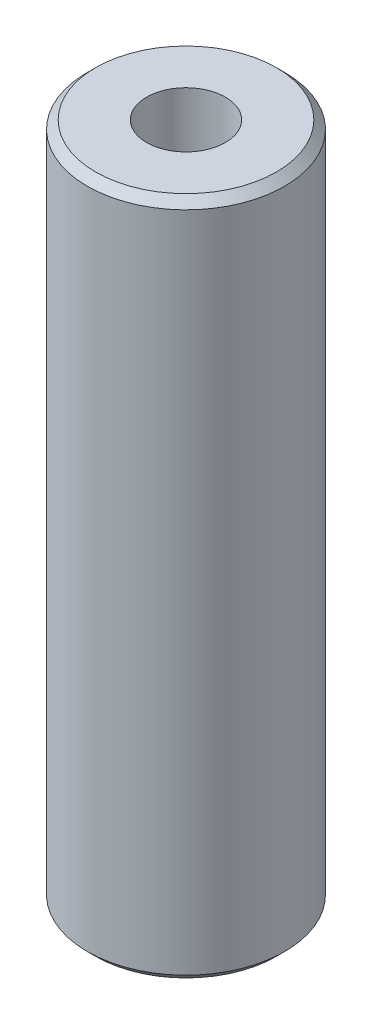
ISO-10303-21;
HEADER;
FILE_DESCRIPTION(('STEP AP214'),'2;1');
FILE_NAME('part.step','',(''),(''),'','','');
FILE_SCHEMA(('AUTOMOTIVE_DESIGN { 1 0 10303 214 1 1 1 1 }'));
ENDSEC;
DATA;
#1=APPLICATION_CONTEXT('core data for automotive mechanical design processes');
#2=APPLICATION_PROTOCOL_DEFINITION('international standard','automotive_design',2000,#1);
#3=PRODUCT_CONTEXT('',#1,'mechanical');
#4=PRODUCT('Part','Part','',(#3));
#5=PRODUCT_RELATED_PRODUCT_CATEGORY('part','',(#4));
#6=PRODUCT_DEFINITION_FORMATION('','',#4);
#7=PRODUCT_DEFINITION_CONTEXT('part definition',#1,'design');
#8=PRODUCT_DEFINITION('design','',#6,#7);
#9=PRODUCT_DEFINITION_SHAPE('','',#8);
#10=(LENGTH_UNIT() NAMED_UNIT(*) SI_UNIT(.MILLI.,.METRE.));
#11=(NAMED_UNIT(*) PLANE_ANGLE_UNIT() SI_UNIT($,.RADIAN.));
#12=(NAMED_UNIT(*) SI_UNIT($,.STERADIAN.) SOLID_ANGLE_UNIT());
#13=UNCERTAINTY_MEASURE_WITH_UNIT(LENGTH_MEASURE(1.E-05),#10,'distance_accuracy_value','');
#14=(GEOMETRIC_REPRESENTATION_CONTEXT(3) GLOBAL_UNCERTAINTY_ASSIGNED_CONTEXT((#13)) GLOBAL_UNIT_ASSIGNED_CONTEXT((#10,
#11,#12)) REPRESENTATION_CONTEXT('',''));
#15=CARTESIAN_POINT('',(0.,0.,0.));
#16=DIRECTION('',(0.,0.,1.));
#17=DIRECTION('',(1.,0.,0.));
#18=AXIS2_PLACEMENT_3D('',#15,#16,#17);
#19=CARTESIAN_POINT('',(0.,395.940282164828,0.));
#20=DIRECTION('',(0.,-1.,0.));
#21=DIRECTION('',(0.,0.,-1.));
#22=AXIS2_PLACEMENT_3D('',#19,#20,#21);
#23=CYLINDRICAL_SURFACE('',#22,57.5);
#24=CARTESIAN_POINT('',(0.,391.143993663756,0.));
#25=DIRECTION('',(0.,1.,0.));
#26=DIRECTION('',(0.,0.,1.));
#27=AXIS2_PLACEMENT_3D('',#24,#25,#26);
#28=CIRCLE('',#27,57.5);
#29=CARTESIAN_POINT('',(0.,391.143993663756,57.5));
#30=VERTEX_POINT('',#29);
#31=EDGE_CURVE('E50',#30,#30,#28,.F.);
#32=ORIENTED_EDGE('',*,*,#31,.T.);
#33=EDGE_LOOP('',(#32));
#34=FACE_BOUND('',#33,.T.);
#35=CARTESIAN_POINT('',(0.,4.79628850107244,0.));
#36=DIRECTION('',(0.,1.,0.));
#37=DIRECTION('',(0.,0.,1.));
#38=AXIS2_PLACEMENT_3D('',#35,#36,#37);
#39=CIRCLE('',#38,57.5);
#40=CARTESIAN_POINT('',(0.,4.79628850107244,57.5));
#41=VERTEX_POINT('',#40);
#42=EDGE_CURVE('E51',#41,#41,#39,.T.);
#43=ORIENTED_EDGE('',*,*,#42,.T.);
#44=EDGE_LOOP('',(#43));
#45=FACE_BOUND('',#44,.T.);
#46=ADVANCED_FACE('F39',(#34,#45),#23,.T.);
#47=CARTESIAN_POINT('',(0.,395.940282164828,0.));
#48=DIRECTION('',(0.,1.,0.));
#49=DIRECTION('',(0.,0.,1.));
#50=AXIS2_PLACEMENT_3D('',#47,#48,#49);
#51=PLANE('',#50);
#52=CARTESIAN_POINT('',(0.,395.940282164828,0.));
#53=DIRECTION('',(0.,1.,0.));
#54=DIRECTION('',(0.,0.,1.));
#55=AXIS2_PLACEMENT_3D('',#52,#53,#54);
#56=CIRCLE('',#55,52.7037114989276);
#57=CARTESIAN_POINT('',(0.,395.940282164828,52.7037114989276));
#58=VERTEX_POINT('',#57);
#59=EDGE_CURVE('E54',#58,#58,#56,.T.);
#60=ORIENTED_EDGE('',*,*,#59,.T.);
#61=EDGE_LOOP('',(#60));
#62=FACE_BOUND('',#61,.T.);
#63=CARTESIAN_POINT('',(0.,395.940282164828,0.));
#64=DIRECTION('',(0.,1.,0.));
#65=DIRECTION('',(0.,0.,1.));
#66=AXIS2_PLACEMENT_3D('',#63,#64,#65);
#67=CIRCLE('',#66,22.9557935545625);
#68=CARTESIAN_POINT('',(0.,395.940282164828,22.9557935545625));
#69=VERTEX_POINT('',#68);
#70=EDGE_CURVE('E58',#69,#69,#67,.T.);
#71=ORIENTED_EDGE('',*,*,#70,.F.);
#72=EDGE_LOOP('',(#71));
#73=FACE_BOUND('',#72,.T.);
#74=ADVANCED_FACE('F69',(#62,#73),#51,.T.);
#75=CARTESIAN_POINT('',(0.,0.,0.));
#76=DIRECTION('',(0.,1.,0.));
#77=DIRECTION('',(0.,0.,1.));
#78=AXIS2_PLACEMENT_3D('',#75,#76,#77);
#79=PLANE('',#78);
#80=CARTESIAN_POINT('',(0.,0.,0.));
#81=DIRECTION('',(0.,1.,0.));
#82=DIRECTION('',(0.,0.,1.));
#83=AXIS2_PLACEMENT_3D('',#80,#81,#82);
#84=CIRCLE('',#83,52.7037114989276);
#85=CARTESIAN_POINT('',(0.,0.,52.7037114989276));
#86=VERTEX_POINT('',#85);
#87=EDGE_CURVE('E10',#86,#86,#84,.F.);
#88=ORIENTED_EDGE('',*,*,#87,.T.);
#89=EDGE_LOOP('',(#88));
#90=FACE_BOUND('',#89,.T.);
#91=CARTESIAN_POINT('',(0.,0.,0.));
#92=DIRECTION('',(0.,1.,0.));
#93=DIRECTION('',(0.,0.,1.));
#94=AXIS2_PLACEMENT_3D('',#91,#92,#93);
#95=CIRCLE('',#94,22.9557935545625);
#96=CARTESIAN_POINT('',(0.,0.,22.9557935545625));
#97=VERTEX_POINT('',#96);
#98=EDGE_CURVE('E63',#97,#97,#95,.T.);
#99=ORIENTED_EDGE('',*,*,#98,.T.);
#100=EDGE_LOOP('',(#99));
#101=FACE_BOUND('',#100,.T.);
#102=ADVANCED_FACE('F75',(#90,#101),#79,.F.);
#103=CARTESIAN_POINT('',(0.,395.940282164828,0.));
#104=DIRECTION('',(0.,-1.,0.));
#105=DIRECTION('',(0.,0.,-1.));
#106=AXIS2_PLACEMENT_3D('',#103,#104,#105);
#107=CYLINDRICAL_SURFACE('',#106,22.9557935545625);
#108=ORIENTED_EDGE('',*,*,#70,.T.);
#109=EDGE_LOOP('',(#108));
#110=FACE_BOUND('',#109,.T.);
#111=ORIENTED_EDGE('',*,*,#98,.F.);
#112=EDGE_LOOP('',(#111));
#113=FACE_BOUND('',#112,.T.);
#114=ADVANCED_FACE('F70',(#110,#113),#107,.F.);
#115=CARTESIAN_POINT('',(0.,395.940282164828,0.));
#116=DIRECTION('',(0.,-1.,0.));
#117=DIRECTION('',(0.,0.,-1.));
#118=AXIS2_PLACEMENT_3D('',#115,#116,#117);
#119=CONICAL_SURFACE('',#118,52.7037114989276,0.785398163397449);
#120=ORIENTED_EDGE('',*,*,#31,.F.);
#121=EDGE_LOOP('',(#120));
#122=FACE_BOUND('',#121,.T.);
#123=ORIENTED_EDGE('',*,*,#59,.F.);
#124=EDGE_LOOP('',(#123));
#125=FACE_BOUND('',#124,.T.);
#126=ADVANCED_FACE('F81',(#122,#125),#119,.T.);
#127=CARTESIAN_POINT('',(0.,4.79628850107244,0.));
#128=DIRECTION('',(0.,1.,0.));
#129=DIRECTION('',(0.,0.,1.));
#130=AXIS2_PLACEMENT_3D('',#127,#128,#129);
#131=CONICAL_SURFACE('',#130,57.5,0.785398163397448);
#132=ORIENTED_EDGE('',*,*,#87,.F.);
#133=EDGE_LOOP('',(#132));
#134=FACE_BOUND('',#133,.T.);
#135=ORIENTED_EDGE('',*,*,#42,.F.);
#136=EDGE_LOOP('',(#135));
#137=FACE_BOUND('',#136,.T.);
#138=ADVANCED_FACE('F45',(#134,#137),#131,.T.);
#139=CLOSED_SHELL('',(#46,#74,#102,#114,#126,#138));
#140=MANIFOLD_SOLID_BREP('B2',#139);
#141=ADVANCED_BREP_SHAPE_REPRESENTATION('',(#18,#140),#14);
#142=SHAPE_DEFINITION_REPRESENTATION(#9,#141);
ENDSEC;
END-ISO-10303-21;
